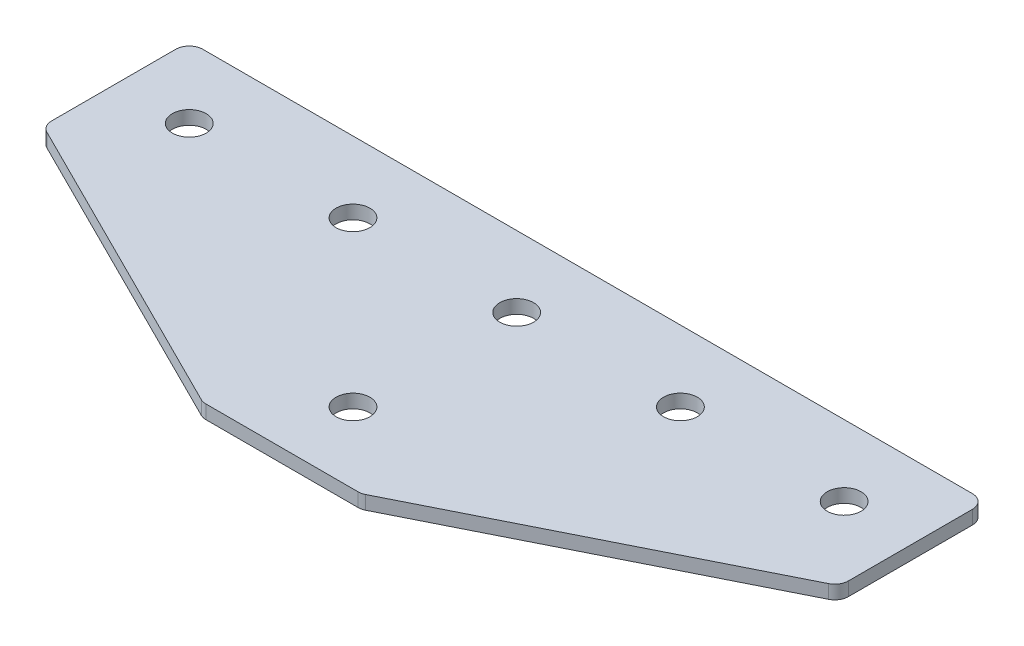
ISO-10303-21;
HEADER;
FILE_DESCRIPTION(('STEP AP214'),'2;1');
FILE_NAME('part.step','',(''),(''),'','','');
FILE_SCHEMA(('AUTOMOTIVE_DESIGN { 1 0 10303 214 1 1 1 1 }'));
ENDSEC;
DATA;
#1=APPLICATION_CONTEXT('core data for automotive mechanical design processes');
#2=APPLICATION_PROTOCOL_DEFINITION('international standard','automotive_design',2000,#1);
#3=PRODUCT_CONTEXT('',#1,'mechanical');
#4=PRODUCT('Part','Part','',(#3));
#5=PRODUCT_RELATED_PRODUCT_CATEGORY('part','',(#4));
#6=PRODUCT_DEFINITION_FORMATION('','',#4);
#7=PRODUCT_DEFINITION_CONTEXT('part definition',#1,'design');
#8=PRODUCT_DEFINITION('design','',#6,#7);
#9=PRODUCT_DEFINITION_SHAPE('','',#8);
#10=(LENGTH_UNIT() NAMED_UNIT(*) SI_UNIT(.MILLI.,.METRE.));
#11=(NAMED_UNIT(*) PLANE_ANGLE_UNIT() SI_UNIT($,.RADIAN.));
#12=(NAMED_UNIT(*) SI_UNIT($,.STERADIAN.) SOLID_ANGLE_UNIT());
#13=UNCERTAINTY_MEASURE_WITH_UNIT(LENGTH_MEASURE(1.E-05),#10,'distance_accuracy_value','');
#14=(GEOMETRIC_REPRESENTATION_CONTEXT(3) GLOBAL_UNCERTAINTY_ASSIGNED_CONTEXT((#13)) GLOBAL_UNIT_ASSIGNED_CONTEXT((#10,
#11,#12)) REPRESENTATION_CONTEXT('',''));
#15=CARTESIAN_POINT('',(0.,0.,0.));
#16=DIRECTION('',(0.,0.,1.));
#17=DIRECTION('',(1.,0.,0.));
#18=AXIS2_PLACEMENT_3D('',#15,#16,#17);
#19=CARTESIAN_POINT('',(-1.6121183435871,1.02470932674123,-15.6622213091418));
#20=DIRECTION('',(0.,-1.,0.));
#21=DIRECTION('',(0.,0.,-1.));
#22=AXIS2_PLACEMENT_3D('',#19,#20,#21);
#23=PLANE('',#22);
#24=CARTESIAN_POINT('',(-1.6121183435871,1.02470932674123,-15.6622213091418));
#25=DIRECTION('',(0.,1.,0.));
#26=DIRECTION('',(0.,0.,1.));
#27=AXIS2_PLACEMENT_3D('',#24,#25,#26);
#28=CIRCLE('',#27,3.1);
#29=CARTESIAN_POINT('',(-1.6121183435871,1.02470932674123,-12.5622213091418));
#30=VERTEX_POINT('',#29);
#31=EDGE_CURVE('E119',#30,#30,#28,.T.);
#32=ORIENTED_EDGE('',*,*,#31,.T.);
#33=EDGE_LOOP('',(#32));
#34=FACE_BOUND('',#33,.T.);
#35=DIRECTION('',(1.,0.,0.));
#36=VECTOR('',#35,1.);
#37=CARTESIAN_POINT('',(-14.6121183435872,1.02470932674123,27.3377786908582));
#38=LINE('',#37,#36);
#39=CARTESIAN_POINT('',(-15.5498124448381,1.02470932674123,27.3377786908582));
#40=VERTEX_POINT('',#39);
#41=CARTESIAN_POINT('',(12.325575757664,1.02470932674123,27.3377786908582));
#42=VERTEX_POINT('',#41);
#43=EDGE_CURVE('E164',#40,#42,#38,.T.);
#44=ORIENTED_EDGE('',*,*,#43,.F.);
#45=CARTESIAN_POINT('',(-15.5498124448381,1.02470932674123,24.8377786908582));
#46=DIRECTION('',(0.,1.,0.));
#47=DIRECTION('',(0.,0.,-1.));
#48=AXIS2_PLACEMENT_3D('',#45,#46,#47);
#49=CIRCLE('',#48,2.5);
#50=CARTESIAN_POINT('',(-16.667846433588,1.02470932674123,27.073846668358));
#51=VERTEX_POINT('',#50);
#52=EDGE_CURVE('E221',#51,#40,#49,.T.);
#53=ORIENTED_EDGE('',*,*,#52,.F.);
#54=DIRECTION('',(-0.894427190999916,0.,-0.447213595499958));
#55=VECTOR('',#54,1.);
#56=CARTESIAN_POINT('',(-16.1399823885876,1.02470932674123,27.3377786908582));
#57=LINE('',#56,#55);
#58=CARTESIAN_POINT('',(-73.2301523323369,1.02470932674123,-1.20730628101648));
#59=VERTEX_POINT('',#58);
#60=EDGE_CURVE('E224',#51,#59,#57,.T.);
#61=ORIENTED_EDGE('',*,*,#60,.T.);
#62=CARTESIAN_POINT('',(-72.112118343587,1.02470932674123,-3.44337425851627));
#63=DIRECTION('',(0.,1.,0.));
#64=DIRECTION('',(0.,0.,-1.));
#65=AXIS2_PLACEMENT_3D('',#62,#63,#64);
#66=CIRCLE('',#65,2.5);
#67=CARTESIAN_POINT('',(-74.612118343587,1.02470932674123,-3.44337425851627));
#68=VERTEX_POINT('',#67);
#69=EDGE_CURVE('E227',#68,#59,#66,.T.);
#70=ORIENTED_EDGE('',*,*,#69,.F.);
#71=DIRECTION('',(0.,0.,-1.));
#72=VECTOR('',#71,1.);
#73=CARTESIAN_POINT('',(-74.612118343587,1.02470932674123,-1.89828928664153));
#74=LINE('',#73,#72);
#75=CARTESIAN_POINT('',(-74.612118343587,1.02470932674123,-26.1622213091418));
#76=VERTEX_POINT('',#75);
#77=EDGE_CURVE('E130',#68,#76,#74,.T.);
#78=ORIENTED_EDGE('',*,*,#77,.T.);
#79=CARTESIAN_POINT('',(-72.112118343587,1.02470932674123,-26.1622213091418));
#80=DIRECTION('',(0.,1.,0.));
#81=DIRECTION('',(0.,0.,-1.));
#82=AXIS2_PLACEMENT_3D('',#79,#80,#81);
#83=CIRCLE('',#82,2.5);
#84=CARTESIAN_POINT('',(-72.112118343587,1.02470932674123,-28.6622213091418));
#85=VERTEX_POINT('',#84);
#86=EDGE_CURVE('E233',#85,#76,#83,.T.);
#87=ORIENTED_EDGE('',*,*,#86,.F.);
#88=DIRECTION('',(-1.,0.,0.));
#89=VECTOR('',#88,1.);
#90=CARTESIAN_POINT('',(71.3878816564128,1.02470932674123,-28.6622213091418));
#91=LINE('',#90,#89);
#92=CARTESIAN_POINT('',(68.8878816564128,1.02470932674123,-28.6622213091418));
#93=VERTEX_POINT('',#92);
#94=EDGE_CURVE('E134',#93,#85,#91,.T.);
#95=ORIENTED_EDGE('',*,*,#94,.F.);
#96=CARTESIAN_POINT('',(68.8878816564128,1.02470932674123,-26.1622213091418));
#97=DIRECTION('',(0.,-1.,0.));
#98=DIRECTION('',(0.,0.,-1.));
#99=AXIS2_PLACEMENT_3D('',#96,#97,#98);
#100=CIRCLE('',#99,2.5);
#101=CARTESIAN_POINT('',(71.3878816564128,1.02470932674123,-26.1622213091418));
#102=VERTEX_POINT('',#101);
#103=EDGE_CURVE('E185',#93,#102,#100,.T.);
#104=ORIENTED_EDGE('',*,*,#103,.T.);
#105=DIRECTION('',(0.,0.,-1.));
#106=VECTOR('',#105,1.);
#107=CARTESIAN_POINT('',(71.3878816564128,1.02470932674123,-1.89828928664155));
#108=LINE('',#107,#106);
#109=CARTESIAN_POINT('',(71.3878816564128,1.02470932674123,-3.44337425851629));
#110=VERTEX_POINT('',#109);
#111=EDGE_CURVE('E169',#110,#102,#108,.T.);
#112=ORIENTED_EDGE('',*,*,#111,.F.);
#113=CARTESIAN_POINT('',(68.8878816564128,1.02470932674123,-3.44337425851629));
#114=DIRECTION('',(0.,-1.,0.));
#115=DIRECTION('',(0.,0.,-1.));
#116=AXIS2_PLACEMENT_3D('',#113,#114,#115);
#117=CIRCLE('',#116,2.5);
#118=CARTESIAN_POINT('',(70.0059156451627,1.02470932674123,-1.2073062810165));
#119=VERTEX_POINT('',#118);
#120=EDGE_CURVE('E31',#110,#119,#117,.T.);
#121=ORIENTED_EDGE('',*,*,#120,.T.);
#122=DIRECTION('',(0.894427190999916,0.,-0.447213595499958));
#123=VECTOR('',#122,1.);
#124=CARTESIAN_POINT('',(12.9157457014134,1.02470932674123,27.3377786908582));
#125=LINE('',#124,#123);
#126=CARTESIAN_POINT('',(13.4436097464139,1.02470932674123,27.0738466683579));
#127=VERTEX_POINT('',#126);
#128=EDGE_CURVE('E167',#127,#119,#125,.T.);
#129=ORIENTED_EDGE('',*,*,#128,.F.);
#130=CARTESIAN_POINT('',(12.325575757664,1.02470932674123,24.8377786908582));
#131=DIRECTION('',(0.,-1.,0.));
#132=DIRECTION('',(0.,0.,-1.));
#133=AXIS2_PLACEMENT_3D('',#130,#131,#132);
#134=CIRCLE('',#133,2.5);
#135=EDGE_CURVE('E188',#127,#42,#134,.T.);
#136=ORIENTED_EDGE('',*,*,#135,.T.);
#137=EDGE_LOOP('',(#44,#53,#61,#70,#78,#87,#95,#104,#112,#121,#129,#136));
#138=FACE_BOUND('',#137,.T.);
#139=CARTESIAN_POINT('',(-1.61211834358711,1.02470932674123,14.3377786908582));
#140=DIRECTION('',(0.,1.,0.));
#141=DIRECTION('',(0.,0.,1.));
#142=AXIS2_PLACEMENT_3D('',#139,#140,#141);
#143=CIRCLE('',#142,3.1);
#144=CARTESIAN_POINT('',(-1.61211834358711,1.02470932674123,17.4377786908582));
#145=VERTEX_POINT('',#144);
#146=EDGE_CURVE('E147',#145,#145,#143,.T.);
#147=ORIENTED_EDGE('',*,*,#146,.T.);
#148=EDGE_LOOP('',(#147));
#149=FACE_BOUND('',#148,.T.);
#150=CARTESIAN_POINT('',(58.3878816564129,1.02470932674123,-15.6622213091418));
#151=DIRECTION('',(0.,1.,0.));
#152=DIRECTION('',(0.,0.,1.));
#153=AXIS2_PLACEMENT_3D('',#150,#151,#152);
#154=CIRCLE('',#153,3.1);
#155=CARTESIAN_POINT('',(58.3878816564129,1.02470932674123,-12.5622213091418));
#156=VERTEX_POINT('',#155);
#157=EDGE_CURVE('E139',#156,#156,#154,.T.);
#158=ORIENTED_EDGE('',*,*,#157,.T.);
#159=EDGE_LOOP('',(#158));
#160=FACE_BOUND('',#159,.T.);
#161=CARTESIAN_POINT('',(28.3878816564129,1.02470932674123,-15.6622213091418));
#162=DIRECTION('',(0.,1.,0.));
#163=DIRECTION('',(0.,0.,1.));
#164=AXIS2_PLACEMENT_3D('',#161,#162,#163);
#165=CIRCLE('',#164,3.1);
#166=CARTESIAN_POINT('',(28.3878816564129,1.02470932674123,-12.5622213091418));
#167=VERTEX_POINT('',#166);
#168=EDGE_CURVE('E153',#167,#167,#165,.T.);
#169=ORIENTED_EDGE('',*,*,#168,.T.);
#170=EDGE_LOOP('',(#169));
#171=FACE_BOUND('',#170,.T.);
#172=CARTESIAN_POINT('',(-61.6121183435871,1.02470932674123,-15.6622213091418));
#173=DIRECTION('',(0.,-1.,0.));
#174=DIRECTION('',(0.,0.,1.));
#175=AXIS2_PLACEMENT_3D('',#172,#173,#174);
#176=CIRCLE('',#175,3.1);
#177=CARTESIAN_POINT('',(-61.6121183435871,1.02470932674123,-12.5622213091418));
#178=VERTEX_POINT('',#177);
#179=EDGE_CURVE('E423',#178,#178,#176,.T.);
#180=ORIENTED_EDGE('',*,*,#179,.F.);
#181=EDGE_LOOP('',(#180));
#182=FACE_BOUND('',#181,.T.);
#183=CARTESIAN_POINT('',(-31.6121183435871,1.02470932674123,-15.6622213091418));
#184=DIRECTION('',(0.,-1.,0.));
#185=DIRECTION('',(0.,0.,1.));
#186=AXIS2_PLACEMENT_3D('',#183,#184,#185);
#187=CIRCLE('',#186,3.1);
#188=CARTESIAN_POINT('',(-31.6121183435871,1.02470932674123,-12.5622213091418));
#189=VERTEX_POINT('',#188);
#190=EDGE_CURVE('E254',#189,#189,#187,.T.);
#191=ORIENTED_EDGE('',*,*,#190,.F.);
#192=EDGE_LOOP('',(#191));
#193=FACE_BOUND('',#192,.T.);
#194=ADVANCED_FACE('F16',(#34,#138,#149,#160,#171,#182,#193),#23,.T.);
#195=CARTESIAN_POINT('',(71.3878816564128,1.02470932674123,-28.6622213091418));
#196=DIRECTION('',(0.,0.,-1.));
#197=DIRECTION('',(-1.,0.,0.));
#198=AXIS2_PLACEMENT_3D('',#195,#196,#197);
#199=PLANE('',#198);
#200=ORIENTED_EDGE('',*,*,#94,.T.);
#201=DIRECTION('',(0.,1.,0.));
#202=VECTOR('',#201,1.);
#203=CARTESIAN_POINT('',(-72.112118343587,1.02470932674123,-28.6622213091418));
#204=LINE('',#203,#202);
#205=CARTESIAN_POINT('',(-72.112118343587,3.52470932674123,-28.6622213091418));
#206=VERTEX_POINT('',#205);
#207=EDGE_CURVE('E125',#206,#85,#204,.F.);
#208=ORIENTED_EDGE('',*,*,#207,.F.);
#209=DIRECTION('',(-1.,0.,0.));
#210=VECTOR('',#209,1.);
#211=CARTESIAN_POINT('',(71.3878816564128,3.52470932674123,-28.6622213091418));
#212=LINE('',#211,#210);
#213=CARTESIAN_POINT('',(68.8878816564128,3.52470932674123,-28.6622213091418));
#214=VERTEX_POINT('',#213);
#215=EDGE_CURVE('E105',#214,#206,#212,.T.);
#216=ORIENTED_EDGE('',*,*,#215,.F.);
#217=DIRECTION('',(0.,1.,0.));
#218=VECTOR('',#217,1.);
#219=CARTESIAN_POINT('',(68.8878816564128,1.02470932674123,-28.6622213091418));
#220=LINE('',#219,#218);
#221=EDGE_CURVE('E10',#214,#93,#220,.F.);
#222=ORIENTED_EDGE('',*,*,#221,.T.);
#223=EDGE_LOOP('',(#200,#208,#216,#222));
#224=FACE_BOUND('',#223,.T.);
#225=ADVANCED_FACE('F132',(#224),#199,.T.);
#226=CARTESIAN_POINT('',(71.3878816564128,1.02470932674123,-1.89828928664155));
#227=DIRECTION('',(1.,0.,0.));
#228=DIRECTION('',(0.,0.,-1.));
#229=AXIS2_PLACEMENT_3D('',#226,#227,#228);
#230=PLANE('',#229);
#231=DIRECTION('',(0.,0.,-1.));
#232=VECTOR('',#231,1.);
#233=CARTESIAN_POINT('',(71.3878816564128,3.52470932674123,-1.89828928664155));
#234=LINE('',#233,#232);
#235=CARTESIAN_POINT('',(71.3878816564128,3.52470932674123,-3.44337425851629));
#236=VERTEX_POINT('',#235);
#237=CARTESIAN_POINT('',(71.3878816564128,3.52470932674123,-26.1622213091418));
#238=VERTEX_POINT('',#237);
#239=EDGE_CURVE('E165',#236,#238,#234,.T.);
#240=ORIENTED_EDGE('',*,*,#239,.F.);
#241=DIRECTION('',(0.,1.,0.));
#242=VECTOR('',#241,1.);
#243=CARTESIAN_POINT('',(71.3878816564128,1.02470932674123,-3.44337425851629));
#244=LINE('',#243,#242);
#245=EDGE_CURVE('E24',#236,#110,#244,.F.);
#246=ORIENTED_EDGE('',*,*,#245,.T.);
#247=ORIENTED_EDGE('',*,*,#111,.T.);
#248=DIRECTION('',(0.,1.,0.));
#249=VECTOR('',#248,1.);
#250=CARTESIAN_POINT('',(71.3878816564128,1.02470932674123,-26.1622213091418));
#251=LINE('',#250,#249);
#252=EDGE_CURVE('E195',#102,#238,#251,.T.);
#253=ORIENTED_EDGE('',*,*,#252,.T.);
#254=EDGE_LOOP('',(#240,#246,#247,#253));
#255=FACE_BOUND('',#254,.T.);
#256=ADVANCED_FACE('F200',(#255),#230,.T.);
#257=CARTESIAN_POINT('',(12.9157457014134,1.02470932674123,27.3377786908582));
#258=DIRECTION('',(0.447213595499958,0.,0.894427190999916));
#259=DIRECTION('',(0.894427190999916,0.,-0.447213595499958));
#260=AXIS2_PLACEMENT_3D('',#257,#258,#259);
#261=PLANE('',#260);
#262=DIRECTION('',(0.894427190999916,0.,-0.447213595499958));
#263=VECTOR('',#262,1.);
#264=CARTESIAN_POINT('',(12.9157457014134,3.52470932674123,27.3377786908582));
#265=LINE('',#264,#263);
#266=CARTESIAN_POINT('',(13.4436097464139,3.52470932674123,27.0738466683579));
#267=VERTEX_POINT('',#266);
#268=CARTESIAN_POINT('',(70.0059156451627,3.52470932674123,-1.2073062810165));
#269=VERTEX_POINT('',#268);
#270=EDGE_CURVE('E173',#267,#269,#265,.T.);
#271=ORIENTED_EDGE('',*,*,#270,.F.);
#272=DIRECTION('',(0.,1.,0.));
#273=VECTOR('',#272,1.);
#274=CARTESIAN_POINT('',(13.4436097464139,1.02470932674123,27.0738466683579));
#275=LINE('',#274,#273);
#276=EDGE_CURVE('E38',#267,#127,#275,.F.);
#277=ORIENTED_EDGE('',*,*,#276,.T.);
#278=ORIENTED_EDGE('',*,*,#128,.T.);
#279=DIRECTION('',(0.,1.,0.));
#280=VECTOR('',#279,1.);
#281=CARTESIAN_POINT('',(70.0059156451627,1.02470932674123,-1.2073062810165));
#282=LINE('',#281,#280);
#283=EDGE_CURVE('E191',#119,#269,#282,.T.);
#284=ORIENTED_EDGE('',*,*,#283,.T.);
#285=EDGE_LOOP('',(#271,#277,#278,#284));
#286=FACE_BOUND('',#285,.T.);
#287=ADVANCED_FACE('F207',(#286),#261,.T.);
#288=CARTESIAN_POINT('',(-14.6121183435872,1.02470932674123,27.3377786908582));
#289=DIRECTION('',(0.,0.,1.));
#290=DIRECTION('',(1.,0.,0.));
#291=AXIS2_PLACEMENT_3D('',#288,#289,#290);
#292=PLANE('',#291);
#293=DIRECTION('',(1.,0.,0.));
#294=VECTOR('',#293,1.);
#295=CARTESIAN_POINT('',(-14.6121183435872,3.52470932674123,27.3377786908582));
#296=LINE('',#295,#294);
#297=CARTESIAN_POINT('',(-15.5498124448381,3.52470932674123,27.3377786908582));
#298=VERTEX_POINT('',#297);
#299=CARTESIAN_POINT('',(12.325575757664,3.52470932674123,27.3377786908582));
#300=VERTEX_POINT('',#299);
#301=EDGE_CURVE('E118',#298,#300,#296,.T.);
#302=ORIENTED_EDGE('',*,*,#301,.F.);
#303=DIRECTION('',(0.,1.,0.));
#304=VECTOR('',#303,1.);
#305=CARTESIAN_POINT('',(-15.5498124448381,1.02470932674123,27.3377786908582));
#306=LINE('',#305,#304);
#307=EDGE_CURVE('E217',#40,#298,#306,.T.);
#308=ORIENTED_EDGE('',*,*,#307,.F.);
#309=ORIENTED_EDGE('',*,*,#43,.T.);
#310=DIRECTION('',(0.,1.,0.));
#311=VECTOR('',#310,1.);
#312=CARTESIAN_POINT('',(12.325575757664,1.02470932674123,27.3377786908582));
#313=LINE('',#312,#311);
#314=EDGE_CURVE('E182',#42,#300,#313,.T.);
#315=ORIENTED_EDGE('',*,*,#314,.T.);
#316=EDGE_LOOP('',(#302,#308,#309,#315));
#317=FACE_BOUND('',#316,.T.);
#318=ADVANCED_FACE('F214',(#317),#292,.T.);
#319=CARTESIAN_POINT('',(-1.6121183435871,3.52470932674123,-15.6622213091418));
#320=DIRECTION('',(0.,-1.,0.));
#321=DIRECTION('',(0.,0.,-1.));
#322=AXIS2_PLACEMENT_3D('',#319,#320,#321);
#323=PLANE('',#322);
#324=CARTESIAN_POINT('',(-1.6121183435871,3.52470932674123,-15.6622213091418));
#325=DIRECTION('',(0.,1.,0.));
#326=DIRECTION('',(0.,0.,1.));
#327=AXIS2_PLACEMENT_3D('',#324,#325,#326);
#328=CIRCLE('',#327,3.1);
#329=CARTESIAN_POINT('',(-1.6121183435871,3.52470932674123,-12.5622213091418));
#330=VERTEX_POINT('',#329);
#331=EDGE_CURVE('E156',#330,#330,#328,.T.);
#332=ORIENTED_EDGE('',*,*,#331,.F.);
#333=EDGE_LOOP('',(#332));
#334=FACE_BOUND('',#333,.T.);
#335=CARTESIAN_POINT('',(-15.5498124448381,3.52470932674123,24.8377786908582));
#336=DIRECTION('',(0.,1.,0.));
#337=DIRECTION('',(0.,0.,-1.));
#338=AXIS2_PLACEMENT_3D('',#335,#336,#337);
#339=CIRCLE('',#338,2.5);
#340=CARTESIAN_POINT('',(-16.667846433588,3.52470932674123,27.073846668358));
#341=VERTEX_POINT('',#340);
#342=EDGE_CURVE('E239',#298,#341,#339,.F.);
#343=ORIENTED_EDGE('',*,*,#342,.F.);
#344=ORIENTED_EDGE('',*,*,#301,.T.);
#345=CARTESIAN_POINT('',(12.325575757664,3.52470932674123,24.8377786908582));
#346=DIRECTION('',(0.,-1.,0.));
#347=DIRECTION('',(0.,0.,-1.));
#348=AXIS2_PLACEMENT_3D('',#345,#346,#347);
#349=CIRCLE('',#348,2.5);
#350=EDGE_CURVE('E180',#300,#267,#349,.F.);
#351=ORIENTED_EDGE('',*,*,#350,.T.);
#352=ORIENTED_EDGE('',*,*,#270,.T.);
#353=CARTESIAN_POINT('',(68.8878816564128,3.52470932674123,-3.44337425851629));
#354=DIRECTION('',(0.,-1.,0.));
#355=DIRECTION('',(0.,0.,-1.));
#356=AXIS2_PLACEMENT_3D('',#353,#354,#355);
#357=CIRCLE('',#356,2.5);
#358=EDGE_CURVE('E178',#269,#236,#357,.F.);
#359=ORIENTED_EDGE('',*,*,#358,.T.);
#360=ORIENTED_EDGE('',*,*,#239,.T.);
#361=CARTESIAN_POINT('',(68.8878816564128,3.52470932674123,-26.1622213091418));
#362=DIRECTION('',(0.,-1.,0.));
#363=DIRECTION('',(0.,0.,-1.));
#364=AXIS2_PLACEMENT_3D('',#361,#362,#363);
#365=CIRCLE('',#364,2.5);
#366=EDGE_CURVE('E114',#238,#214,#365,.F.);
#367=ORIENTED_EDGE('',*,*,#366,.T.);
#368=ORIENTED_EDGE('',*,*,#215,.T.);
#369=CARTESIAN_POINT('',(-72.112118343587,3.52470932674123,-26.1622213091418));
#370=DIRECTION('',(0.,1.,0.));
#371=DIRECTION('',(0.,0.,-1.));
#372=AXIS2_PLACEMENT_3D('',#369,#370,#371);
#373=CIRCLE('',#372,2.5);
#374=CARTESIAN_POINT('',(-74.612118343587,3.52470932674123,-26.1622213091418));
#375=VERTEX_POINT('',#374);
#376=EDGE_CURVE('E111',#375,#206,#373,.F.);
#377=ORIENTED_EDGE('',*,*,#376,.F.);
#378=DIRECTION('',(0.,0.,-1.));
#379=VECTOR('',#378,1.);
#380=CARTESIAN_POINT('',(-74.612118343587,3.52470932674123,-1.89828928664153));
#381=LINE('',#380,#379);
#382=CARTESIAN_POINT('',(-74.612118343587,3.52470932674123,-3.44337425851627));
#383=VERTEX_POINT('',#382);
#384=EDGE_CURVE('E244',#383,#375,#381,.T.);
#385=ORIENTED_EDGE('',*,*,#384,.F.);
#386=CARTESIAN_POINT('',(-72.112118343587,3.52470932674123,-3.44337425851627));
#387=DIRECTION('',(0.,1.,0.));
#388=DIRECTION('',(0.,0.,-1.));
#389=AXIS2_PLACEMENT_3D('',#386,#387,#388);
#390=CIRCLE('',#389,2.5);
#391=CARTESIAN_POINT('',(-73.2301523323369,3.52470932674123,-1.20730628101648));
#392=VERTEX_POINT('',#391);
#393=EDGE_CURVE('E129',#392,#383,#390,.F.);
#394=ORIENTED_EDGE('',*,*,#393,.F.);
#395=DIRECTION('',(-0.894427190999916,0.,-0.447213595499958));
#396=VECTOR('',#395,1.);
#397=CARTESIAN_POINT('',(-16.1399823885876,3.52470932674123,27.3377786908582));
#398=LINE('',#397,#396);
#399=EDGE_CURVE('E248',#341,#392,#398,.T.);
#400=ORIENTED_EDGE('',*,*,#399,.F.);
#401=EDGE_LOOP('',(#343,#344,#351,#352,#359,#360,#367,#368,#377,#385,#394,#400));
#402=FACE_BOUND('',#401,.T.);
#403=CARTESIAN_POINT('',(58.3878816564129,3.52470932674123,-15.6622213091418));
#404=DIRECTION('',(0.,1.,0.));
#405=DIRECTION('',(0.,0.,1.));
#406=AXIS2_PLACEMENT_3D('',#403,#404,#405);
#407=CIRCLE('',#406,3.1);
#408=CARTESIAN_POINT('',(58.3878816564129,3.52470932674123,-12.5622213091418));
#409=VERTEX_POINT('',#408);
#410=EDGE_CURVE('E135',#409,#409,#407,.T.);
#411=ORIENTED_EDGE('',*,*,#410,.F.);
#412=EDGE_LOOP('',(#411));
#413=FACE_BOUND('',#412,.T.);
#414=CARTESIAN_POINT('',(28.3878816564129,3.52470932674123,-15.6622213091418));
#415=DIRECTION('',(0.,1.,0.));
#416=DIRECTION('',(0.,0.,1.));
#417=AXIS2_PLACEMENT_3D('',#414,#415,#416);
#418=CIRCLE('',#417,3.1);
#419=CARTESIAN_POINT('',(28.3878816564129,3.52470932674123,-12.5622213091418));
#420=VERTEX_POINT('',#419);
#421=EDGE_CURVE('E150',#420,#420,#418,.T.);
#422=ORIENTED_EDGE('',*,*,#421,.F.);
#423=EDGE_LOOP('',(#422));
#424=FACE_BOUND('',#423,.T.);
#425=CARTESIAN_POINT('',(-1.61211834358711,3.52470932674123,14.3377786908582));
#426=DIRECTION('',(0.,1.,0.));
#427=DIRECTION('',(0.,0.,1.));
#428=AXIS2_PLACEMENT_3D('',#425,#426,#427);
#429=CIRCLE('',#428,3.1);
#430=CARTESIAN_POINT('',(-1.61211834358711,3.52470932674123,17.4377786908582));
#431=VERTEX_POINT('',#430);
#432=EDGE_CURVE('E145',#431,#431,#429,.T.);
#433=ORIENTED_EDGE('',*,*,#432,.F.);
#434=EDGE_LOOP('',(#433));
#435=FACE_BOUND('',#434,.T.);
#436=CARTESIAN_POINT('',(-61.6121183435871,3.52470932674123,-15.6622213091418));
#437=DIRECTION('',(0.,-1.,0.));
#438=DIRECTION('',(0.,0.,1.));
#439=AXIS2_PLACEMENT_3D('',#436,#437,#438);
#440=CIRCLE('',#439,3.1);
#441=CARTESIAN_POINT('',(-61.6121183435871,3.52470932674123,-12.5622213091418));
#442=VERTEX_POINT('',#441);
#443=EDGE_CURVE('E426',#442,#442,#440,.T.);
#444=ORIENTED_EDGE('',*,*,#443,.T.);
#445=EDGE_LOOP('',(#444));
#446=FACE_BOUND('',#445,.T.);
#447=CARTESIAN_POINT('',(-31.6121183435871,3.52470932674123,-15.6622213091418));
#448=DIRECTION('',(0.,-1.,0.));
#449=DIRECTION('',(0.,0.,1.));
#450=AXIS2_PLACEMENT_3D('',#447,#448,#449);
#451=CIRCLE('',#450,3.1);
#452=CARTESIAN_POINT('',(-31.6121183435871,3.52470932674123,-12.5622213091418));
#453=VERTEX_POINT('',#452);
#454=EDGE_CURVE('E251',#453,#453,#451,.T.);
#455=ORIENTED_EDGE('',*,*,#454,.T.);
#456=EDGE_LOOP('',(#455));
#457=FACE_BOUND('',#456,.T.);
#458=ADVANCED_FACE('F108',(#334,#402,#413,#424,#435,#446,#457),#323,.F.);
#459=CARTESIAN_POINT('',(12.325575757664,1.02470932674123,24.8377786908582));
#460=DIRECTION('',(0.,1.,0.));
#461=DIRECTION('',(0.,0.,1.));
#462=AXIS2_PLACEMENT_3D('',#459,#460,#461);
#463=CYLINDRICAL_SURFACE('',#462,2.5);
#464=ORIENTED_EDGE('',*,*,#135,.F.);
#465=ORIENTED_EDGE('',*,*,#276,.F.);
#466=ORIENTED_EDGE('',*,*,#350,.F.);
#467=ORIENTED_EDGE('',*,*,#314,.F.);
#468=EDGE_LOOP('',(#464,#465,#466,#467));
#469=FACE_BOUND('',#468,.T.);
#470=ADVANCED_FACE('F212',(#469),#463,.T.);
#471=CARTESIAN_POINT('',(68.8878816564128,1.02470932674123,-3.44337425851629));
#472=DIRECTION('',(0.,1.,0.));
#473=DIRECTION('',(0.,0.,1.));
#474=AXIS2_PLACEMENT_3D('',#471,#472,#473);
#475=CYLINDRICAL_SURFACE('',#474,2.5);
#476=ORIENTED_EDGE('',*,*,#120,.F.);
#477=ORIENTED_EDGE('',*,*,#245,.F.);
#478=ORIENTED_EDGE('',*,*,#358,.F.);
#479=ORIENTED_EDGE('',*,*,#283,.F.);
#480=EDGE_LOOP('',(#476,#477,#478,#479));
#481=FACE_BOUND('',#480,.T.);
#482=ADVANCED_FACE('F206',(#481),#475,.T.);
#483=CARTESIAN_POINT('',(68.8878816564128,1.02470932674123,-26.1622213091418));
#484=DIRECTION('',(0.,1.,0.));
#485=DIRECTION('',(0.,0.,1.));
#486=AXIS2_PLACEMENT_3D('',#483,#484,#485);
#487=CYLINDRICAL_SURFACE('',#486,2.5);
#488=ORIENTED_EDGE('',*,*,#103,.F.);
#489=ORIENTED_EDGE('',*,*,#221,.F.);
#490=ORIENTED_EDGE('',*,*,#366,.F.);
#491=ORIENTED_EDGE('',*,*,#252,.F.);
#492=EDGE_LOOP('',(#488,#489,#490,#491));
#493=FACE_BOUND('',#492,.T.);
#494=ADVANCED_FACE('F18',(#493),#487,.T.);
#495=CARTESIAN_POINT('',(-1.6121183435871,1.02470932674123,-15.6622213091418));
#496=DIRECTION('',(0.,1.,0.));
#497=DIRECTION('',(0.,0.,1.));
#498=AXIS2_PLACEMENT_3D('',#495,#496,#497);
#499=CYLINDRICAL_SURFACE('',#498,3.1);
#500=ORIENTED_EDGE('',*,*,#31,.F.);
#501=EDGE_LOOP('',(#500));
#502=FACE_BOUND('',#501,.T.);
#503=ORIENTED_EDGE('',*,*,#331,.T.);
#504=EDGE_LOOP('',(#503));
#505=FACE_BOUND('',#504,.T.);
#506=ADVANCED_FACE('F288',(#502,#505),#499,.F.);
#507=CARTESIAN_POINT('',(28.3878816564129,1.02470932674123,-15.6622213091418));
#508=DIRECTION('',(0.,1.,0.));
#509=DIRECTION('',(0.,0.,1.));
#510=AXIS2_PLACEMENT_3D('',#507,#508,#509);
#511=CYLINDRICAL_SURFACE('',#510,3.1);
#512=ORIENTED_EDGE('',*,*,#168,.F.);
#513=EDGE_LOOP('',(#512));
#514=FACE_BOUND('',#513,.T.);
#515=ORIENTED_EDGE('',*,*,#421,.T.);
#516=EDGE_LOOP('',(#515));
#517=FACE_BOUND('',#516,.T.);
#518=ADVANCED_FACE('F293',(#514,#517),#511,.F.);
#519=CARTESIAN_POINT('',(-1.61211834358711,1.02470932674123,14.3377786908582));
#520=DIRECTION('',(0.,1.,0.));
#521=DIRECTION('',(0.,0.,1.));
#522=AXIS2_PLACEMENT_3D('',#519,#520,#521);
#523=CYLINDRICAL_SURFACE('',#522,3.1);
#524=ORIENTED_EDGE('',*,*,#432,.T.);
#525=EDGE_LOOP('',(#524));
#526=FACE_BOUND('',#525,.T.);
#527=ORIENTED_EDGE('',*,*,#146,.F.);
#528=EDGE_LOOP('',(#527));
#529=FACE_BOUND('',#528,.T.);
#530=ADVANCED_FACE('F299',(#526,#529),#523,.F.);
#531=CARTESIAN_POINT('',(58.3878816564129,1.02470932674123,-15.6622213091418));
#532=DIRECTION('',(0.,1.,0.));
#533=DIRECTION('',(0.,0.,1.));
#534=AXIS2_PLACEMENT_3D('',#531,#532,#533);
#535=CYLINDRICAL_SURFACE('',#534,3.1);
#536=ORIENTED_EDGE('',*,*,#157,.F.);
#537=EDGE_LOOP('',(#536));
#538=FACE_BOUND('',#537,.T.);
#539=ORIENTED_EDGE('',*,*,#410,.T.);
#540=EDGE_LOOP('',(#539));
#541=FACE_BOUND('',#540,.T.);
#542=ADVANCED_FACE('F354',(#538,#541),#535,.F.);
#543=CARTESIAN_POINT('',(-74.612118343587,1.02470932674123,-1.89828928664153));
#544=DIRECTION('',(-1.,0.,0.));
#545=DIRECTION('',(0.,0.,-1.));
#546=AXIS2_PLACEMENT_3D('',#543,#544,#545);
#547=PLANE('',#546);
#548=ORIENTED_EDGE('',*,*,#384,.T.);
#549=DIRECTION('',(0.,1.,0.));
#550=VECTOR('',#549,1.);
#551=CARTESIAN_POINT('',(-74.612118343587,1.02470932674123,-26.1622213091418));
#552=LINE('',#551,#550);
#553=EDGE_CURVE('E127',#76,#375,#552,.T.);
#554=ORIENTED_EDGE('',*,*,#553,.F.);
#555=ORIENTED_EDGE('',*,*,#77,.F.);
#556=DIRECTION('',(0.,1.,0.));
#557=VECTOR('',#556,1.);
#558=CARTESIAN_POINT('',(-74.612118343587,1.02470932674123,-3.44337425851627));
#559=LINE('',#558,#557);
#560=EDGE_CURVE('E136',#383,#68,#559,.F.);
#561=ORIENTED_EDGE('',*,*,#560,.F.);
#562=EDGE_LOOP('',(#548,#554,#555,#561));
#563=FACE_BOUND('',#562,.T.);
#564=ADVANCED_FACE('F261',(#563),#547,.T.);
#565=CARTESIAN_POINT('',(-16.1399823885876,1.02470932674123,27.3377786908582));
#566=DIRECTION('',(-0.447213595499958,0.,0.894427190999916));
#567=DIRECTION('',(-0.894427190999916,0.,-0.447213595499958));
#568=AXIS2_PLACEMENT_3D('',#565,#566,#567);
#569=PLANE('',#568);
#570=ORIENTED_EDGE('',*,*,#399,.T.);
#571=DIRECTION('',(0.,1.,0.));
#572=VECTOR('',#571,1.);
#573=CARTESIAN_POINT('',(-73.2301523323369,1.02470932674123,-1.20730628101648));
#574=LINE('',#573,#572);
#575=EDGE_CURVE('E226',#59,#392,#574,.T.);
#576=ORIENTED_EDGE('',*,*,#575,.F.);
#577=ORIENTED_EDGE('',*,*,#60,.F.);
#578=DIRECTION('',(0.,1.,0.));
#579=VECTOR('',#578,1.);
#580=CARTESIAN_POINT('',(-16.667846433588,1.02470932674123,27.073846668358));
#581=LINE('',#580,#579);
#582=EDGE_CURVE('E230',#341,#51,#581,.F.);
#583=ORIENTED_EDGE('',*,*,#582,.F.);
#584=EDGE_LOOP('',(#570,#576,#577,#583));
#585=FACE_BOUND('',#584,.T.);
#586=ADVANCED_FACE('F243',(#585),#569,.T.);
#587=CARTESIAN_POINT('',(-15.5498124448381,1.02470932674123,24.8377786908582));
#588=DIRECTION('',(0.,1.,0.));
#589=DIRECTION('',(0.,0.,1.));
#590=AXIS2_PLACEMENT_3D('',#587,#588,#589);
#591=CYLINDRICAL_SURFACE('',#590,2.5);
#592=ORIENTED_EDGE('',*,*,#52,.T.);
#593=ORIENTED_EDGE('',*,*,#307,.T.);
#594=ORIENTED_EDGE('',*,*,#342,.T.);
#595=ORIENTED_EDGE('',*,*,#582,.T.);
#596=EDGE_LOOP('',(#592,#593,#594,#595));
#597=FACE_BOUND('',#596,.T.);
#598=ADVANCED_FACE('F238',(#597),#591,.T.);
#599=CARTESIAN_POINT('',(-72.112118343587,1.02470932674123,-3.44337425851627));
#600=DIRECTION('',(0.,1.,0.));
#601=DIRECTION('',(0.,0.,1.));
#602=AXIS2_PLACEMENT_3D('',#599,#600,#601);
#603=CYLINDRICAL_SURFACE('',#602,2.5);
#604=ORIENTED_EDGE('',*,*,#69,.T.);
#605=ORIENTED_EDGE('',*,*,#575,.T.);
#606=ORIENTED_EDGE('',*,*,#393,.T.);
#607=ORIENTED_EDGE('',*,*,#560,.T.);
#608=EDGE_LOOP('',(#604,#605,#606,#607));
#609=FACE_BOUND('',#608,.T.);
#610=ADVANCED_FACE('F263',(#609),#603,.T.);
#611=CARTESIAN_POINT('',(-72.112118343587,1.02470932674123,-26.1622213091418));
#612=DIRECTION('',(0.,1.,0.));
#613=DIRECTION('',(0.,0.,1.));
#614=AXIS2_PLACEMENT_3D('',#611,#612,#613);
#615=CYLINDRICAL_SURFACE('',#614,2.5);
#616=ORIENTED_EDGE('',*,*,#86,.T.);
#617=ORIENTED_EDGE('',*,*,#553,.T.);
#618=ORIENTED_EDGE('',*,*,#376,.T.);
#619=ORIENTED_EDGE('',*,*,#207,.T.);
#620=EDGE_LOOP('',(#616,#617,#618,#619));
#621=FACE_BOUND('',#620,.T.);
#622=ADVANCED_FACE('F124',(#621),#615,.T.);
#623=CARTESIAN_POINT('',(-31.6121183435871,1.02470932674123,-15.6622213091418));
#624=DIRECTION('',(0.,1.,0.));
#625=DIRECTION('',(0.,0.,1.));
#626=AXIS2_PLACEMENT_3D('',#623,#624,#625);
#627=CYLINDRICAL_SURFACE('',#626,3.1);
#628=ORIENTED_EDGE('',*,*,#190,.T.);
#629=EDGE_LOOP('',(#628));
#630=FACE_BOUND('',#629,.T.);
#631=ORIENTED_EDGE('',*,*,#454,.F.);
#632=EDGE_LOOP('',(#631));
#633=FACE_BOUND('',#632,.T.);
#634=ADVANCED_FACE('F271',(#630,#633),#627,.F.);
#635=CARTESIAN_POINT('',(-61.6121183435871,1.02470932674123,-15.6622213091418));
#636=DIRECTION('',(0.,1.,0.));
#637=DIRECTION('',(0.,0.,1.));
#638=AXIS2_PLACEMENT_3D('',#635,#636,#637);
#639=CYLINDRICAL_SURFACE('',#638,3.1);
#640=ORIENTED_EDGE('',*,*,#179,.T.);
#641=EDGE_LOOP('',(#640));
#642=FACE_BOUND('',#641,.T.);
#643=ORIENTED_EDGE('',*,*,#443,.F.);
#644=EDGE_LOOP('',(#643));
#645=FACE_BOUND('',#644,.T.);
#646=ADVANCED_FACE('F404',(#642,#645),#639,.F.);
#647=CLOSED_SHELL('',(#194,#225,#256,#287,#318,#458,#470,#482,#494,#506,#518,#530,#542,#564,
#586,#598,#610,#622,#634,#646));
#648=MANIFOLD_SOLID_BREP('B1',#647);
#649=ADVANCED_BREP_SHAPE_REPRESENTATION('',(#18,#648),#14);
#650=SHAPE_DEFINITION_REPRESENTATION(#9,#649);
ENDSEC;
END-ISO-10303-21;
